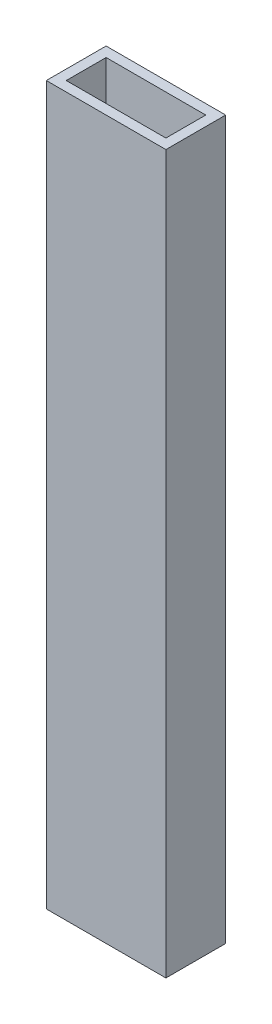
ISO-10303-21;
HEADER;
FILE_DESCRIPTION(('STEP AP214'),'2;1');
FILE_NAME('part.step','',(''),(''),'','','');
FILE_SCHEMA(('AUTOMOTIVE_DESIGN { 1 0 10303 214 1 1 1 1 }'));
ENDSEC;
DATA;
#1=APPLICATION_CONTEXT('core data for automotive mechanical design processes');
#2=APPLICATION_PROTOCOL_DEFINITION('international standard','automotive_design',2000,#1);
#3=PRODUCT_CONTEXT('',#1,'mechanical');
#4=PRODUCT('Part','Part','',(#3));
#5=PRODUCT_RELATED_PRODUCT_CATEGORY('part','',(#4));
#6=PRODUCT_DEFINITION_FORMATION('','',#4);
#7=PRODUCT_DEFINITION_CONTEXT('part definition',#1,'design');
#8=PRODUCT_DEFINITION('design','',#6,#7);
#9=PRODUCT_DEFINITION_SHAPE('','',#8);
#10=(LENGTH_UNIT() NAMED_UNIT(*) SI_UNIT(.MILLI.,.METRE.));
#11=(NAMED_UNIT(*) PLANE_ANGLE_UNIT() SI_UNIT($,.RADIAN.));
#12=(NAMED_UNIT(*) SI_UNIT($,.STERADIAN.) SOLID_ANGLE_UNIT());
#13=UNCERTAINTY_MEASURE_WITH_UNIT(LENGTH_MEASURE(1.E-05),#10,'distance_accuracy_value','');
#14=(GEOMETRIC_REPRESENTATION_CONTEXT(3) GLOBAL_UNCERTAINTY_ASSIGNED_CONTEXT((#13)) GLOBAL_UNIT_ASSIGNED_CONTEXT((#10,
#11,#12)) REPRESENTATION_CONTEXT('',''));
#15=CARTESIAN_POINT('',(0.,0.,0.));
#16=DIRECTION('',(0.,0.,1.));
#17=DIRECTION('',(1.,0.,0.));
#18=AXIS2_PLACEMENT_3D('',#15,#16,#17);
#19=CARTESIAN_POINT('',(0.,228.6,0.));
#20=DIRECTION('',(0.,-1.,0.));
#21=DIRECTION('',(0.,0.,-1.));
#22=AXIS2_PLACEMENT_3D('',#19,#20,#21);
#23=PLANE('',#22);
#24=DIRECTION('',(0.,0.,1.));
#25=VECTOR('',#24,1.);
#26=CARTESIAN_POINT('',(0.,228.6,0.));
#27=LINE('',#26,#25);
#28=CARTESIAN_POINT('',(0.,228.6,-19.05));
#29=VERTEX_POINT('',#28);
#30=CARTESIAN_POINT('',(0.,228.6,0.));
#31=VERTEX_POINT('',#30);
#32=EDGE_CURVE('E171',#29,#31,#27,.T.);
#33=ORIENTED_EDGE('',*,*,#32,.T.);
#34=DIRECTION('',(1.,0.,0.));
#35=VECTOR('',#34,1.);
#36=CARTESIAN_POINT('',(0.,228.6,0.));
#37=LINE('',#36,#35);
#38=CARTESIAN_POINT('',(38.1,228.6,0.));
#39=VERTEX_POINT('',#38);
#40=EDGE_CURVE('E174',#31,#39,#37,.T.);
#41=ORIENTED_EDGE('',*,*,#40,.T.);
#42=DIRECTION('',(0.,0.,-1.));
#43=VECTOR('',#42,1.);
#44=CARTESIAN_POINT('',(38.1,228.6,0.));
#45=LINE('',#44,#43);
#46=CARTESIAN_POINT('',(38.1,228.6,-19.05));
#47=VERTEX_POINT('',#46);
#48=EDGE_CURVE('E177',#39,#47,#45,.T.);
#49=ORIENTED_EDGE('',*,*,#48,.T.);
#50=DIRECTION('',(-1.,0.,0.));
#51=VECTOR('',#50,1.);
#52=CARTESIAN_POINT('',(0.,228.6,-19.05));
#53=LINE('',#52,#51);
#54=EDGE_CURVE('E180',#47,#29,#53,.T.);
#55=ORIENTED_EDGE('',*,*,#54,.T.);
#56=EDGE_LOOP('',(#33,#41,#49,#55));
#57=FACE_BOUND('',#56,.T.);
#58=DIRECTION('',(0.,0.,1.));
#59=VECTOR('',#58,1.);
#60=CARTESIAN_POINT('',(3.175,228.6,-3.175));
#61=LINE('',#60,#59);
#62=CARTESIAN_POINT('',(3.175,228.6,-15.875));
#63=VERTEX_POINT('',#62);
#64=CARTESIAN_POINT('',(3.175,228.6,-3.175));
#65=VERTEX_POINT('',#64);
#66=EDGE_CURVE('E121',#63,#65,#61,.T.);
#67=ORIENTED_EDGE('',*,*,#66,.F.);
#68=DIRECTION('',(-1.,0.,0.));
#69=VECTOR('',#68,1.);
#70=CARTESIAN_POINT('',(3.175,228.6,-15.875));
#71=LINE('',#70,#69);
#72=CARTESIAN_POINT('',(34.925,228.6,-15.875));
#73=VERTEX_POINT('',#72);
#74=EDGE_CURVE('E149',#73,#63,#71,.T.);
#75=ORIENTED_EDGE('',*,*,#74,.F.);
#76=DIRECTION('',(0.,0.,-1.));
#77=VECTOR('',#76,1.);
#78=CARTESIAN_POINT('',(34.925,228.6,-3.175));
#79=LINE('',#78,#77);
#80=CARTESIAN_POINT('',(34.925,228.6,-3.175));
#81=VERTEX_POINT('',#80);
#82=EDGE_CURVE('E143',#81,#73,#79,.T.);
#83=ORIENTED_EDGE('',*,*,#82,.F.);
#84=DIRECTION('',(1.,0.,0.));
#85=VECTOR('',#84,1.);
#86=CARTESIAN_POINT('',(3.175,228.6,-3.175));
#87=LINE('',#86,#85);
#88=EDGE_CURVE('E130',#65,#81,#87,.T.);
#89=ORIENTED_EDGE('',*,*,#88,.F.);
#90=EDGE_LOOP('',(#67,#75,#83,#89));
#91=FACE_BOUND('',#90,.T.);
#92=ADVANCED_FACE('F39',(#57,#91),#23,.F.);
#93=CARTESIAN_POINT('',(0.,0.,0.));
#94=DIRECTION('',(0.,-1.,0.));
#95=DIRECTION('',(0.,0.,-1.));
#96=AXIS2_PLACEMENT_3D('',#93,#94,#95);
#97=PLANE('',#96);
#98=DIRECTION('',(0.,0.,1.));
#99=VECTOR('',#98,1.);
#100=CARTESIAN_POINT('',(0.,0.,0.));
#101=LINE('',#100,#99);
#102=CARTESIAN_POINT('',(0.,0.,-19.05));
#103=VERTEX_POINT('',#102);
#104=CARTESIAN_POINT('',(0.,0.,0.));
#105=VERTEX_POINT('',#104);
#106=EDGE_CURVE('E139',#103,#105,#101,.T.);
#107=ORIENTED_EDGE('',*,*,#106,.F.);
#108=DIRECTION('',(-1.,0.,0.));
#109=VECTOR('',#108,1.);
#110=CARTESIAN_POINT('',(0.,0.,-19.05));
#111=LINE('',#110,#109);
#112=CARTESIAN_POINT('',(38.1,0.,-19.05));
#113=VERTEX_POINT('',#112);
#114=EDGE_CURVE('E175',#113,#103,#111,.T.);
#115=ORIENTED_EDGE('',*,*,#114,.F.);
#116=DIRECTION('',(0.,0.,-1.));
#117=VECTOR('',#116,1.);
#118=CARTESIAN_POINT('',(38.1,0.,0.));
#119=LINE('',#118,#117);
#120=CARTESIAN_POINT('',(38.1,0.,0.));
#121=VERTEX_POINT('',#120);
#122=EDGE_CURVE('E190',#121,#113,#119,.T.);
#123=ORIENTED_EDGE('',*,*,#122,.F.);
#124=DIRECTION('',(1.,0.,0.));
#125=VECTOR('',#124,1.);
#126=CARTESIAN_POINT('',(0.,0.,0.));
#127=LINE('',#126,#125);
#128=EDGE_CURVE('E187',#105,#121,#127,.T.);
#129=ORIENTED_EDGE('',*,*,#128,.F.);
#130=EDGE_LOOP('',(#107,#115,#123,#129));
#131=FACE_BOUND('',#130,.T.);
#132=DIRECTION('',(-1.,0.,0.));
#133=VECTOR('',#132,1.);
#134=CARTESIAN_POINT('',(3.175,0.,-15.875));
#135=LINE('',#134,#133);
#136=CARTESIAN_POINT('',(34.925,0.,-15.875));
#137=VERTEX_POINT('',#136);
#138=CARTESIAN_POINT('',(3.175,0.,-15.875));
#139=VERTEX_POINT('',#138);
#140=EDGE_CURVE('E131',#137,#139,#135,.T.);
#141=ORIENTED_EDGE('',*,*,#140,.T.);
#142=DIRECTION('',(0.,0.,1.));
#143=VECTOR('',#142,1.);
#144=CARTESIAN_POINT('',(3.175,0.,-3.175));
#145=LINE('',#144,#143);
#146=CARTESIAN_POINT('',(3.175,0.,-3.175));
#147=VERTEX_POINT('',#146);
#148=EDGE_CURVE('E69',#139,#147,#145,.T.);
#149=ORIENTED_EDGE('',*,*,#148,.T.);
#150=DIRECTION('',(1.,0.,0.));
#151=VECTOR('',#150,1.);
#152=CARTESIAN_POINT('',(3.175,0.,-3.175));
#153=LINE('',#152,#151);
#154=CARTESIAN_POINT('',(34.925,0.,-3.175));
#155=VERTEX_POINT('',#154);
#156=EDGE_CURVE('E137',#147,#155,#153,.T.);
#157=ORIENTED_EDGE('',*,*,#156,.T.);
#158=DIRECTION('',(0.,0.,-1.));
#159=VECTOR('',#158,1.);
#160=CARTESIAN_POINT('',(34.925,0.,-3.175));
#161=LINE('',#160,#159);
#162=EDGE_CURVE('E158',#155,#137,#161,.T.);
#163=ORIENTED_EDGE('',*,*,#162,.T.);
#164=EDGE_LOOP('',(#141,#149,#157,#163));
#165=FACE_BOUND('',#164,.T.);
#166=ADVANCED_FACE('F213',(#131,#165),#97,.T.);
#167=CARTESIAN_POINT('',(0.,228.6,0.));
#168=DIRECTION('',(1.,0.,0.));
#169=DIRECTION('',(0.,0.,-1.));
#170=AXIS2_PLACEMENT_3D('',#167,#168,#169);
#171=PLANE('',#170);
#172=ORIENTED_EDGE('',*,*,#106,.T.);
#173=DIRECTION('',(0.,-1.,0.));
#174=VECTOR('',#173,1.);
#175=CARTESIAN_POINT('',(0.,228.6,0.));
#176=LINE('',#175,#174);
#177=EDGE_CURVE('E11',#31,#105,#176,.T.);
#178=ORIENTED_EDGE('',*,*,#177,.F.);
#179=ORIENTED_EDGE('',*,*,#32,.F.);
#180=DIRECTION('',(0.,-1.,0.));
#181=VECTOR('',#180,1.);
#182=CARTESIAN_POINT('',(0.,228.6,-19.05));
#183=LINE('',#182,#181);
#184=EDGE_CURVE('E183',#29,#103,#183,.T.);
#185=ORIENTED_EDGE('',*,*,#184,.T.);
#186=EDGE_LOOP('',(#172,#178,#179,#185));
#187=FACE_BOUND('',#186,.T.);
#188=ADVANCED_FACE('F41',(#187),#171,.F.);
#189=CARTESIAN_POINT('',(0.,228.6,0.));
#190=DIRECTION('',(0.,0.,-1.));
#191=DIRECTION('',(-1.,0.,0.));
#192=AXIS2_PLACEMENT_3D('',#189,#190,#191);
#193=PLANE('',#192);
#194=ORIENTED_EDGE('',*,*,#128,.T.);
#195=DIRECTION('',(0.,-1.,0.));
#196=VECTOR('',#195,1.);
#197=CARTESIAN_POINT('',(38.1,228.6,0.));
#198=LINE('',#197,#196);
#199=EDGE_CURVE('E48',#39,#121,#198,.T.);
#200=ORIENTED_EDGE('',*,*,#199,.F.);
#201=ORIENTED_EDGE('',*,*,#40,.F.);
#202=ORIENTED_EDGE('',*,*,#177,.T.);
#203=EDGE_LOOP('',(#194,#200,#201,#202));
#204=FACE_BOUND('',#203,.T.);
#205=ADVANCED_FACE('F223',(#204),#193,.F.);
#206=CARTESIAN_POINT('',(38.1,228.6,0.));
#207=DIRECTION('',(-1.,0.,0.));
#208=DIRECTION('',(0.,0.,1.));
#209=AXIS2_PLACEMENT_3D('',#206,#207,#208);
#210=PLANE('',#209);
#211=ORIENTED_EDGE('',*,*,#122,.T.);
#212=DIRECTION('',(0.,-1.,0.));
#213=VECTOR('',#212,1.);
#214=CARTESIAN_POINT('',(38.1,228.6,-19.05));
#215=LINE('',#214,#213);
#216=EDGE_CURVE('E198',#47,#113,#215,.T.);
#217=ORIENTED_EDGE('',*,*,#216,.F.);
#218=ORIENTED_EDGE('',*,*,#48,.F.);
#219=ORIENTED_EDGE('',*,*,#199,.T.);
#220=EDGE_LOOP('',(#211,#217,#218,#219));
#221=FACE_BOUND('',#220,.T.);
#222=ADVANCED_FACE('F207',(#221),#210,.F.);
#223=CARTESIAN_POINT('',(0.,228.6,-19.05));
#224=DIRECTION('',(0.,0.,1.));
#225=DIRECTION('',(1.,0.,0.));
#226=AXIS2_PLACEMENT_3D('',#223,#224,#225);
#227=PLANE('',#226);
#228=ORIENTED_EDGE('',*,*,#114,.T.);
#229=ORIENTED_EDGE('',*,*,#184,.F.);
#230=ORIENTED_EDGE('',*,*,#54,.F.);
#231=ORIENTED_EDGE('',*,*,#216,.T.);
#232=EDGE_LOOP('',(#228,#229,#230,#231));
#233=FACE_BOUND('',#232,.T.);
#234=ADVANCED_FACE('F217',(#233),#227,.F.);
#235=CARTESIAN_POINT('',(3.175,228.6,-3.175));
#236=DIRECTION('',(1.,0.,0.));
#237=DIRECTION('',(0.,0.,-1.));
#238=AXIS2_PLACEMENT_3D('',#235,#236,#237);
#239=PLANE('',#238);
#240=ORIENTED_EDGE('',*,*,#148,.F.);
#241=DIRECTION('',(0.,-1.,0.));
#242=VECTOR('',#241,1.);
#243=CARTESIAN_POINT('',(3.175,228.6,-15.875));
#244=LINE('',#243,#242);
#245=EDGE_CURVE('E125',#63,#139,#244,.T.);
#246=ORIENTED_EDGE('',*,*,#245,.F.);
#247=ORIENTED_EDGE('',*,*,#66,.T.);
#248=DIRECTION('',(0.,-1.,0.));
#249=VECTOR('',#248,1.);
#250=CARTESIAN_POINT('',(3.175,228.6,-3.175));
#251=LINE('',#250,#249);
#252=EDGE_CURVE('E124',#65,#147,#251,.T.);
#253=ORIENTED_EDGE('',*,*,#252,.T.);
#254=EDGE_LOOP('',(#240,#246,#247,#253));
#255=FACE_BOUND('',#254,.T.);
#256=ADVANCED_FACE('F123',(#255),#239,.T.);
#257=CARTESIAN_POINT('',(3.175,228.6,-3.175));
#258=DIRECTION('',(0.,0.,-1.));
#259=DIRECTION('',(-1.,0.,0.));
#260=AXIS2_PLACEMENT_3D('',#257,#258,#259);
#261=PLANE('',#260);
#262=ORIENTED_EDGE('',*,*,#156,.F.);
#263=ORIENTED_EDGE('',*,*,#252,.F.);
#264=ORIENTED_EDGE('',*,*,#88,.T.);
#265=DIRECTION('',(0.,-1.,0.));
#266=VECTOR('',#265,1.);
#267=CARTESIAN_POINT('',(34.925,228.6,-3.175));
#268=LINE('',#267,#266);
#269=EDGE_CURVE('E140',#81,#155,#268,.T.);
#270=ORIENTED_EDGE('',*,*,#269,.T.);
#271=EDGE_LOOP('',(#262,#263,#264,#270));
#272=FACE_BOUND('',#271,.T.);
#273=ADVANCED_FACE('F134',(#272),#261,.T.);
#274=CARTESIAN_POINT('',(34.925,228.6,-3.175));
#275=DIRECTION('',(-1.,0.,0.));
#276=DIRECTION('',(0.,0.,1.));
#277=AXIS2_PLACEMENT_3D('',#274,#275,#276);
#278=PLANE('',#277);
#279=ORIENTED_EDGE('',*,*,#162,.F.);
#280=ORIENTED_EDGE('',*,*,#269,.F.);
#281=ORIENTED_EDGE('',*,*,#82,.T.);
#282=DIRECTION('',(0.,-1.,0.));
#283=VECTOR('',#282,1.);
#284=CARTESIAN_POINT('',(34.925,228.6,-15.875));
#285=LINE('',#284,#283);
#286=EDGE_CURVE('E58',#73,#137,#285,.T.);
#287=ORIENTED_EDGE('',*,*,#286,.T.);
#288=EDGE_LOOP('',(#279,#280,#281,#287));
#289=FACE_BOUND('',#288,.T.);
#290=ADVANCED_FACE('F246',(#289),#278,.T.);
#291=CARTESIAN_POINT('',(3.175,228.6,-15.875));
#292=DIRECTION('',(0.,0.,1.));
#293=DIRECTION('',(1.,0.,0.));
#294=AXIS2_PLACEMENT_3D('',#291,#292,#293);
#295=PLANE('',#294);
#296=ORIENTED_EDGE('',*,*,#140,.F.);
#297=ORIENTED_EDGE('',*,*,#286,.F.);
#298=ORIENTED_EDGE('',*,*,#74,.T.);
#299=ORIENTED_EDGE('',*,*,#245,.T.);
#300=EDGE_LOOP('',(#296,#297,#298,#299));
#301=FACE_BOUND('',#300,.T.);
#302=ADVANCED_FACE('F250',(#301),#295,.T.);
#303=CLOSED_SHELL('',(#92,#166,#188,#205,#222,#234,#256,#273,#290,#302));
#304=MANIFOLD_SOLID_BREP('B2',#303);
#305=ADVANCED_BREP_SHAPE_REPRESENTATION('',(#18,#304),#14);
#306=SHAPE_DEFINITION_REPRESENTATION(#9,#305);
ENDSEC;
END-ISO-10303-21;
